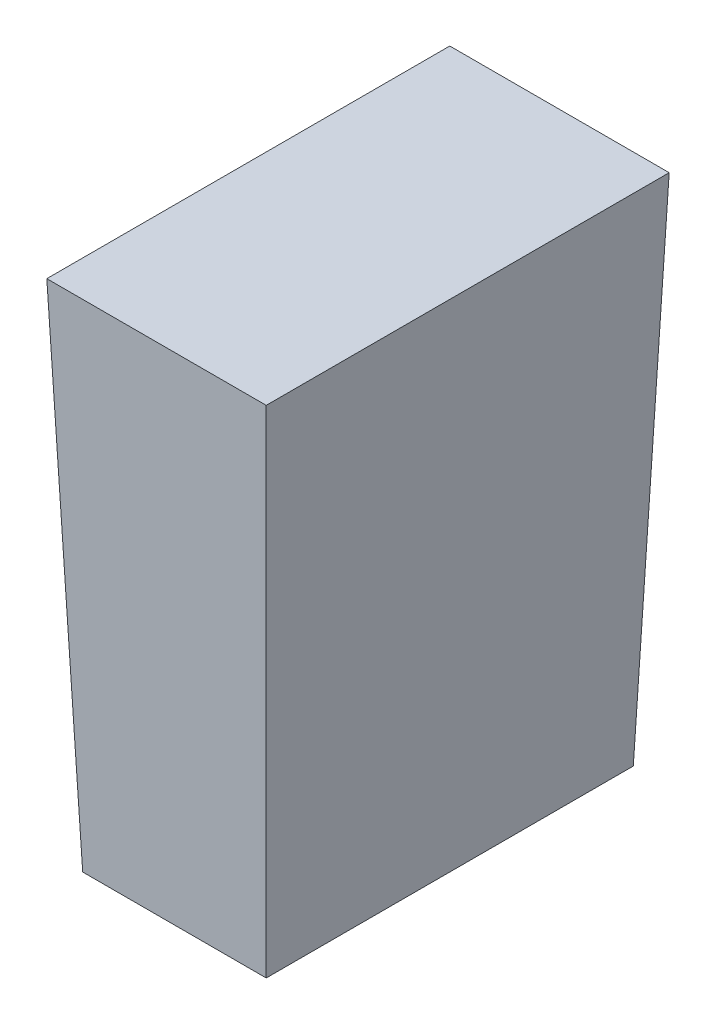
ISO-10303-21;
HEADER;
FILE_DESCRIPTION(('STEP AP214'),'2;1');
FILE_NAME('part.step','',(''),(''),'','','');
FILE_SCHEMA(('AUTOMOTIVE_DESIGN { 1 0 10303 214 1 1 1 1 }'));
ENDSEC;
DATA;
#1=APPLICATION_CONTEXT('core data for automotive mechanical design processes');
#2=APPLICATION_PROTOCOL_DEFINITION('international standard','automotive_design',2000,#1);
#3=PRODUCT_CONTEXT('',#1,'mechanical');
#4=PRODUCT('Part','Part','',(#3));
#5=PRODUCT_RELATED_PRODUCT_CATEGORY('part','',(#4));
#6=PRODUCT_DEFINITION_FORMATION('','',#4);
#7=PRODUCT_DEFINITION_CONTEXT('part definition',#1,'design');
#8=PRODUCT_DEFINITION('design','',#6,#7);
#9=PRODUCT_DEFINITION_SHAPE('','',#8);
#10=(LENGTH_UNIT() NAMED_UNIT(*) SI_UNIT(.MILLI.,.METRE.));
#11=(NAMED_UNIT(*) PLANE_ANGLE_UNIT() SI_UNIT($,.RADIAN.));
#12=(NAMED_UNIT(*) SI_UNIT($,.STERADIAN.) SOLID_ANGLE_UNIT());
#13=UNCERTAINTY_MEASURE_WITH_UNIT(LENGTH_MEASURE(1.E-05),#10,'distance_accuracy_value','');
#14=(GEOMETRIC_REPRESENTATION_CONTEXT(3) GLOBAL_UNCERTAINTY_ASSIGNED_CONTEXT((#13)) GLOBAL_UNIT_ASSIGNED_CONTEXT((#10,
#11,#12)) REPRESENTATION_CONTEXT('',''));
#15=CARTESIAN_POINT('',(0.,0.,0.));
#16=DIRECTION('',(0.,0.,1.));
#17=DIRECTION('',(1.,0.,0.));
#18=AXIS2_PLACEMENT_3D('',#15,#16,#17);
#19=CARTESIAN_POINT('',(-1.5875,0.,-3.175));
#20=DIRECTION('',(-0.999390827019096,-0.034899496702501,0.));
#21=DIRECTION('',(0.034899496702501,-0.999390827019096,0.));
#22=AXIS2_PLACEMENT_3D('',#19,#20,#21);
#23=PLANE('',#22);
#24=DIRECTION('',(0.,0.,1.));
#25=VECTOR('',#24,1.);
#26=CARTESIAN_POINT('',(-1.5875,0.,-3.175));
#27=LINE('',#26,#25);
#28=CARTESIAN_POINT('',(-1.5875,0.,-3.175));
#29=VERTEX_POINT('',#28);
#30=CARTESIAN_POINT('',(-1.5875,0.,3.175));
#31=VERTEX_POINT('',#30);
#32=EDGE_CURVE('E86',#29,#31,#27,.T.);
#33=ORIENTED_EDGE('',*,*,#32,.T.);
#34=DIRECTION('',(0.0348782627423747,-0.998782765958718,-0.0348782627423747));
#35=VECTOR('',#34,1.);
#36=CARTESIAN_POINT('',(-1.58363763405213,-0.110603689554383,3.17113763405214));
#37=LINE('',#36,#35);
#38=CARTESIAN_POINT('',(-1.89794564078164,8.89,3.48544564078164));
#39=VERTEX_POINT('',#38);
#40=EDGE_CURVE('E11',#39,#31,#37,.T.);
#41=ORIENTED_EDGE('',*,*,#40,.F.);
#42=DIRECTION('',(0.,0.,-1.));
#43=VECTOR('',#42,1.);
#44=CARTESIAN_POINT('',(-1.89794564078164,8.89,0.));
#45=LINE('',#44,#43);
#46=CARTESIAN_POINT('',(-1.89794564078164,8.89,-3.48544564078164));
#47=VERTEX_POINT('',#46);
#48=EDGE_CURVE('E106',#47,#39,#45,.F.);
#49=ORIENTED_EDGE('',*,*,#48,.F.);
#50=DIRECTION('',(0.0348782627423747,-0.998782765958718,0.0348782627423747));
#51=VECTOR('',#50,1.);
#52=CARTESIAN_POINT('',(-1.5875,0.,-3.175));
#53=LINE('',#52,#51);
#54=EDGE_CURVE('E98',#47,#29,#53,.T.);
#55=ORIENTED_EDGE('',*,*,#54,.T.);
#56=EDGE_LOOP('',(#33,#41,#49,#55));
#57=FACE_BOUND('',#56,.T.);
#58=ADVANCED_FACE('F39',(#57),#23,.T.);
#59=CARTESIAN_POINT('',(1.5875,0.,3.175));
#60=DIRECTION('',(0.,-0.034899496702501,0.999390827019096));
#61=DIRECTION('',(0.,-0.999390827019096,-0.034899496702501));
#62=AXIS2_PLACEMENT_3D('',#59,#60,#61);
#63=PLANE('',#62);
#64=DIRECTION('',(1.,0.,0.));
#65=VECTOR('',#64,1.);
#66=CARTESIAN_POINT('',(1.5875,0.,3.175));
#67=LINE('',#66,#65);
#68=CARTESIAN_POINT('',(1.5875,0.,3.175));
#69=VERTEX_POINT('',#68);
#70=EDGE_CURVE('E82',#31,#69,#67,.T.);
#71=ORIENTED_EDGE('',*,*,#70,.T.);
#72=DIRECTION('',(-0.0348782627423747,-0.998782765958718,-0.0348782627423747));
#73=VECTOR('',#72,1.);
#74=CARTESIAN_POINT('',(1.57977526810427,-0.221207379108766,3.16727526810427));
#75=LINE('',#74,#73);
#76=CARTESIAN_POINT('',(1.89794564078164,8.89,3.48544564078164));
#77=VERTEX_POINT('',#76);
#78=EDGE_CURVE('E49',#77,#69,#75,.T.);
#79=ORIENTED_EDGE('',*,*,#78,.F.);
#80=DIRECTION('',(-1.,0.,0.));
#81=VECTOR('',#80,1.);
#82=CARTESIAN_POINT('',(0.,8.89,3.48544564078164));
#83=LINE('',#82,#81);
#84=EDGE_CURVE('E94',#39,#77,#83,.F.);
#85=ORIENTED_EDGE('',*,*,#84,.F.);
#86=ORIENTED_EDGE('',*,*,#40,.T.);
#87=EDGE_LOOP('',(#71,#79,#85,#86));
#88=FACE_BOUND('',#87,.T.);
#89=ADVANCED_FACE('F41',(#88),#63,.T.);
#90=CARTESIAN_POINT('',(1.5875,0.,-3.175));
#91=DIRECTION('',(0.999390827019096,-0.034899496702501,0.));
#92=DIRECTION('',(0.034899496702501,0.999390827019096,0.));
#93=AXIS2_PLACEMENT_3D('',#90,#91,#92);
#94=PLANE('',#93);
#95=DIRECTION('',(0.,0.,-1.));
#96=VECTOR('',#95,1.);
#97=CARTESIAN_POINT('',(1.5875,0.,-3.175));
#98=LINE('',#97,#96);
#99=CARTESIAN_POINT('',(1.5875,0.,-3.175));
#100=VERTEX_POINT('',#99);
#101=EDGE_CURVE('E87',#69,#100,#98,.T.);
#102=ORIENTED_EDGE('',*,*,#101,.T.);
#103=DIRECTION('',(-0.0348782627423747,-0.998782765958718,0.0348782627423747));
#104=VECTOR('',#103,1.);
#105=CARTESIAN_POINT('',(1.5875,0.,-3.175));
#106=LINE('',#105,#104);
#107=CARTESIAN_POINT('',(1.89794564078164,8.89,-3.48544564078164));
#108=VERTEX_POINT('',#107);
#109=EDGE_CURVE('E110',#108,#100,#106,.T.);
#110=ORIENTED_EDGE('',*,*,#109,.F.);
#111=DIRECTION('',(0.,0.,1.));
#112=VECTOR('',#111,1.);
#113=CARTESIAN_POINT('',(1.89794564078164,8.89,0.));
#114=LINE('',#113,#112);
#115=EDGE_CURVE('E61',#77,#108,#114,.F.);
#116=ORIENTED_EDGE('',*,*,#115,.F.);
#117=ORIENTED_EDGE('',*,*,#78,.T.);
#118=EDGE_LOOP('',(#102,#110,#116,#117));
#119=FACE_BOUND('',#118,.T.);
#120=ADVANCED_FACE('F123',(#119),#94,.T.);
#121=CARTESIAN_POINT('',(1.5875,0.,-3.175));
#122=DIRECTION('',(0.,-0.034899496702501,-0.999390827019096));
#123=DIRECTION('',(0.,0.999390827019096,-0.034899496702501));
#124=AXIS2_PLACEMENT_3D('',#121,#122,#123);
#125=PLANE('',#124);
#126=DIRECTION('',(-1.,0.,0.));
#127=VECTOR('',#126,1.);
#128=CARTESIAN_POINT('',(1.5875,0.,-3.175));
#129=LINE('',#128,#127);
#130=EDGE_CURVE('E104',#100,#29,#129,.T.);
#131=ORIENTED_EDGE('',*,*,#130,.T.);
#132=ORIENTED_EDGE('',*,*,#54,.F.);
#133=DIRECTION('',(1.,0.,0.));
#134=VECTOR('',#133,1.);
#135=CARTESIAN_POINT('',(0.,8.89,-3.48544564078164));
#136=LINE('',#135,#134);
#137=EDGE_CURVE('E43',#108,#47,#136,.F.);
#138=ORIENTED_EDGE('',*,*,#137,.F.);
#139=ORIENTED_EDGE('',*,*,#109,.T.);
#140=EDGE_LOOP('',(#131,#132,#138,#139));
#141=FACE_BOUND('',#140,.T.);
#142=ADVANCED_FACE('F125',(#141),#125,.T.);
#143=CARTESIAN_POINT('',(0.,8.89,0.));
#144=DIRECTION('',(0.,-1.,0.));
#145=DIRECTION('',(0.,0.,-1.));
#146=AXIS2_PLACEMENT_3D('',#143,#144,#145);
#147=PLANE('',#146);
#148=ORIENTED_EDGE('',*,*,#48,.T.);
#149=ORIENTED_EDGE('',*,*,#84,.T.);
#150=ORIENTED_EDGE('',*,*,#115,.T.);
#151=ORIENTED_EDGE('',*,*,#137,.T.);
#152=EDGE_LOOP('',(#148,#149,#150,#151));
#153=FACE_BOUND('',#152,.T.);
#154=ADVANCED_FACE('F121',(#153),#147,.F.);
#155=CARTESIAN_POINT('',(0.,0.,0.));
#156=DIRECTION('',(0.,-1.,0.));
#157=DIRECTION('',(0.,0.,-1.));
#158=AXIS2_PLACEMENT_3D('',#155,#156,#157);
#159=PLANE('',#158);
#160=ORIENTED_EDGE('',*,*,#32,.F.);
#161=ORIENTED_EDGE('',*,*,#130,.F.);
#162=ORIENTED_EDGE('',*,*,#101,.F.);
#163=ORIENTED_EDGE('',*,*,#70,.F.);
#164=EDGE_LOOP('',(#160,#161,#162,#163));
#165=FACE_BOUND('',#164,.T.);
#166=ADVANCED_FACE('F83',(#165),#159,.T.);
#167=CLOSED_SHELL('',(#58,#89,#120,#142,#154,#166));
#168=MANIFOLD_SOLID_BREP('B2',#167);
#169=ADVANCED_BREP_SHAPE_REPRESENTATION('',(#18,#168),#14);
#170=SHAPE_DEFINITION_REPRESENTATION(#9,#169);
ENDSEC;
END-ISO-10303-21;
